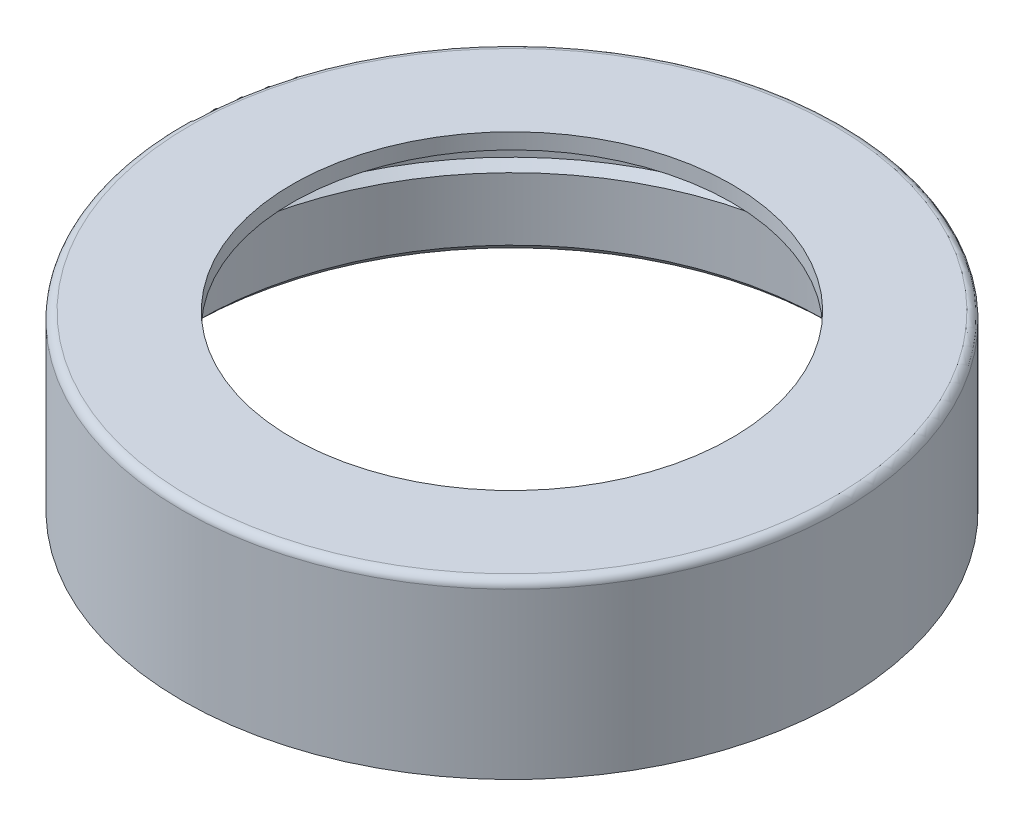
ISO-10303-21;
HEADER;
FILE_DESCRIPTION(('STEP AP214'),'2;1');
FILE_NAME('part.step','',(''),(''),'','','');
FILE_SCHEMA(('AUTOMOTIVE_DESIGN { 1 0 10303 214 1 1 1 1 }'));
ENDSEC;
DATA;
#1=APPLICATION_CONTEXT('core data for automotive mechanical design processes');
#2=APPLICATION_PROTOCOL_DEFINITION('international standard','automotive_design',2000,#1);
#3=PRODUCT_CONTEXT('',#1,'mechanical');
#4=PRODUCT('Part','Part','',(#3));
#5=PRODUCT_RELATED_PRODUCT_CATEGORY('part','',(#4));
#6=PRODUCT_DEFINITION_FORMATION('','',#4);
#7=PRODUCT_DEFINITION_CONTEXT('part definition',#1,'design');
#8=PRODUCT_DEFINITION('design','',#6,#7);
#9=PRODUCT_DEFINITION_SHAPE('','',#8);
#10=(LENGTH_UNIT() NAMED_UNIT(*) SI_UNIT(.MILLI.,.METRE.));
#11=(NAMED_UNIT(*) PLANE_ANGLE_UNIT() SI_UNIT($,.RADIAN.));
#12=(NAMED_UNIT(*) SI_UNIT($,.STERADIAN.) SOLID_ANGLE_UNIT());
#13=UNCERTAINTY_MEASURE_WITH_UNIT(LENGTH_MEASURE(1.E-05),#10,'distance_accuracy_value','');
#14=(GEOMETRIC_REPRESENTATION_CONTEXT(3) GLOBAL_UNCERTAINTY_ASSIGNED_CONTEXT((#13)) GLOBAL_UNIT_ASSIGNED_CONTEXT((#10,
#11,#12)) REPRESENTATION_CONTEXT('',''));
#15=CARTESIAN_POINT('',(0.,0.,0.));
#16=DIRECTION('',(0.,0.,1.));
#17=DIRECTION('',(1.,0.,0.));
#18=AXIS2_PLACEMENT_3D('',#15,#16,#17);
#19=CARTESIAN_POINT('',(-20.5,0.,0.));
#20=DIRECTION('',(0.,1.,0.));
#21=DIRECTION('',(0.,0.,1.));
#22=AXIS2_PLACEMENT_3D('',#19,#20,#21);
#23=PLANE('',#22);
#24=CARTESIAN_POINT('',(0.,0.,0.));
#25=DIRECTION('',(0.,-1.,0.));
#26=DIRECTION('',(0.,0.,-1.));
#27=AXIS2_PLACEMENT_3D('',#24,#25,#26);
#28=CIRCLE('',#27,20.5);
#29=CARTESIAN_POINT('',(0.,0.,-20.5));
#30=VERTEX_POINT('',#29);
#31=EDGE_CURVE('E75',#30,#30,#28,.T.);
#32=ORIENTED_EDGE('',*,*,#31,.F.);
#33=EDGE_LOOP('',(#32));
#34=FACE_BOUND('',#33,.T.);
#35=CARTESIAN_POINT('',(0.,0.,0.));
#36=DIRECTION('',(0.,-1.,0.));
#37=DIRECTION('',(0.,0.,-1.));
#38=AXIS2_PLACEMENT_3D('',#35,#36,#37);
#39=CIRCLE('',#38,21.);
#40=CARTESIAN_POINT('',(0.,0.,-21.));
#41=VERTEX_POINT('',#40);
#42=EDGE_CURVE('E45',#41,#41,#39,.T.);
#43=ORIENTED_EDGE('',*,*,#42,.T.);
#44=EDGE_LOOP('',(#43));
#45=FACE_BOUND('',#44,.T.);
#46=ADVANCED_FACE('F34',(#34,#45),#23,.F.);
#47=CARTESIAN_POINT('',(0.,0.,0.));
#48=DIRECTION('',(0.,-1.,0.));
#49=DIRECTION('',(0.,0.,-1.));
#50=AXIS2_PLACEMENT_3D('',#47,#48,#49);
#51=CYLINDRICAL_SURFACE('',#50,21.);
#52=CARTESIAN_POINT('',(0.,10.5,0.));
#53=DIRECTION('',(0.,-1.,0.));
#54=DIRECTION('',(0.,0.,-1.));
#55=AXIS2_PLACEMENT_3D('',#52,#53,#54);
#56=CIRCLE('',#55,21.);
#57=CARTESIAN_POINT('',(0.,10.5,-21.));
#58=VERTEX_POINT('',#57);
#59=EDGE_CURVE('E41',#58,#58,#56,.T.);
#60=ORIENTED_EDGE('',*,*,#59,.T.);
#61=EDGE_LOOP('',(#60));
#62=FACE_BOUND('',#61,.T.);
#63=ORIENTED_EDGE('',*,*,#42,.F.);
#64=EDGE_LOOP('',(#63));
#65=FACE_BOUND('',#64,.T.);
#66=ADVANCED_FACE('F83',(#62,#65),#51,.T.);
#67=CARTESIAN_POINT('',(-21.,11.,0.));
#68=DIRECTION('',(0.,-1.,0.));
#69=DIRECTION('',(0.,0.,-1.));
#70=AXIS2_PLACEMENT_3D('',#67,#68,#69);
#71=PLANE('',#70);
#72=CARTESIAN_POINT('',(0.,11.,0.));
#73=DIRECTION('',(0.,-1.,0.));
#74=DIRECTION('',(0.,0.,-1.));
#75=AXIS2_PLACEMENT_3D('',#72,#73,#74);
#76=CIRCLE('',#75,20.5);
#77=CARTESIAN_POINT('',(0.,11.,-20.5));
#78=VERTEX_POINT('',#77);
#79=EDGE_CURVE('E10',#78,#78,#76,.F.);
#80=ORIENTED_EDGE('',*,*,#79,.T.);
#81=EDGE_LOOP('',(#80));
#82=FACE_BOUND('',#81,.T.);
#83=CARTESIAN_POINT('',(0.,11.,0.));
#84=DIRECTION('',(0.,-1.,0.));
#85=DIRECTION('',(0.,0.,-1.));
#86=AXIS2_PLACEMENT_3D('',#83,#84,#85);
#87=CIRCLE('',#86,14.);
#88=CARTESIAN_POINT('',(0.,11.,-14.));
#89=VERTEX_POINT('',#88);
#90=EDGE_CURVE('E49',#89,#89,#87,.T.);
#91=ORIENTED_EDGE('',*,*,#90,.T.);
#92=EDGE_LOOP('',(#91));
#93=FACE_BOUND('',#92,.T.);
#94=ADVANCED_FACE('F87',(#82,#93),#71,.F.);
#95=CARTESIAN_POINT('',(0.,0.,0.));
#96=DIRECTION('',(0.,-1.,0.));
#97=DIRECTION('',(0.,0.,-1.));
#98=AXIS2_PLACEMENT_3D('',#95,#96,#97);
#99=CYLINDRICAL_SURFACE('',#98,14.);
#100=ORIENTED_EDGE('',*,*,#90,.F.);
#101=EDGE_LOOP('',(#100));
#102=FACE_BOUND('',#101,.T.);
#103=CARTESIAN_POINT('',(0.,10.,0.));
#104=DIRECTION('',(0.,-1.,0.));
#105=DIRECTION('',(0.,0.,-1.));
#106=AXIS2_PLACEMENT_3D('',#103,#104,#105);
#107=CIRCLE('',#106,14.);
#108=CARTESIAN_POINT('',(0.,10.,-14.));
#109=VERTEX_POINT('',#108);
#110=EDGE_CURVE('E54',#109,#109,#107,.T.);
#111=ORIENTED_EDGE('',*,*,#110,.T.);
#112=EDGE_LOOP('',(#111));
#113=FACE_BOUND('',#112,.T.);
#114=ADVANCED_FACE('F92',(#102,#113),#99,.F.);
#115=CARTESIAN_POINT('',(-14.,10.,0.));
#116=DIRECTION('',(0.,1.,0.));
#117=DIRECTION('',(0.,0.,1.));
#118=AXIS2_PLACEMENT_3D('',#115,#116,#117);
#119=PLANE('',#118);
#120=ORIENTED_EDGE('',*,*,#110,.F.);
#121=EDGE_LOOP('',(#120));
#122=FACE_BOUND('',#121,.T.);
#123=CARTESIAN_POINT('',(0.,10.,0.));
#124=DIRECTION('',(0.,-1.,0.));
#125=DIRECTION('',(0.,0.,-1.));
#126=AXIS2_PLACEMENT_3D('',#123,#124,#125);
#127=CIRCLE('',#126,20.);
#128=CARTESIAN_POINT('',(0.,10.,-20.));
#129=VERTEX_POINT('',#128);
#130=EDGE_CURVE('E57',#129,#129,#127,.T.);
#131=ORIENTED_EDGE('',*,*,#130,.T.);
#132=EDGE_LOOP('',(#131));
#133=FACE_BOUND('',#132,.T.);
#134=ADVANCED_FACE('F97',(#122,#133),#119,.F.);
#135=CARTESIAN_POINT('',(0.,0.,0.));
#136=DIRECTION('',(0.,-1.,0.));
#137=DIRECTION('',(0.,0.,-1.));
#138=AXIS2_PLACEMENT_3D('',#135,#136,#137);
#139=CYLINDRICAL_SURFACE('',#138,20.);
#140=ORIENTED_EDGE('',*,*,#130,.F.);
#141=EDGE_LOOP('',(#140));
#142=FACE_BOUND('',#141,.T.);
#143=CARTESIAN_POINT('',(0.,6.00000000000001,0.));
#144=DIRECTION('',(0.,-1.,0.));
#145=DIRECTION('',(0.,0.,-1.));
#146=AXIS2_PLACEMENT_3D('',#143,#144,#145);
#147=CIRCLE('',#146,20.);
#148=CARTESIAN_POINT('',(0.,6.00000000000001,-20.));
#149=VERTEX_POINT('',#148);
#150=EDGE_CURVE('E60',#149,#149,#147,.T.);
#151=ORIENTED_EDGE('',*,*,#150,.T.);
#152=EDGE_LOOP('',(#151));
#153=FACE_BOUND('',#152,.T.);
#154=ADVANCED_FACE('F101',(#142,#153),#139,.F.);
#155=CARTESIAN_POINT('',(-20.5,6.00000000000001,0.));
#156=DIRECTION('',(0.,1.,0.));
#157=DIRECTION('',(0.,0.,1.));
#158=AXIS2_PLACEMENT_3D('',#155,#156,#157);
#159=PLANE('',#158);
#160=ORIENTED_EDGE('',*,*,#150,.F.);
#161=EDGE_LOOP('',(#160));
#162=FACE_BOUND('',#161,.T.);
#163=CARTESIAN_POINT('',(0.,6.00000000000001,0.));
#164=DIRECTION('',(0.,-1.,0.));
#165=DIRECTION('',(0.,0.,-1.));
#166=AXIS2_PLACEMENT_3D('',#163,#164,#165);
#167=CIRCLE('',#166,20.5);
#168=CARTESIAN_POINT('',(0.,6.00000000000001,-20.5));
#169=VERTEX_POINT('',#168);
#170=EDGE_CURVE('E63',#169,#169,#167,.T.);
#171=ORIENTED_EDGE('',*,*,#170,.T.);
#172=EDGE_LOOP('',(#171));
#173=FACE_BOUND('',#172,.T.);
#174=ADVANCED_FACE('F105',(#162,#173),#159,.F.);
#175=CARTESIAN_POINT('',(0.,0.,0.));
#176=DIRECTION('',(0.,-1.,0.));
#177=DIRECTION('',(0.,0.,-1.));
#178=AXIS2_PLACEMENT_3D('',#175,#176,#177);
#179=CYLINDRICAL_SURFACE('',#178,20.5);
#180=ORIENTED_EDGE('',*,*,#170,.F.);
#181=EDGE_LOOP('',(#180));
#182=FACE_BOUND('',#181,.T.);
#183=CARTESIAN_POINT('',(0.,5.00000000000001,0.));
#184=DIRECTION('',(0.,-1.,0.));
#185=DIRECTION('',(0.,0.,-1.));
#186=AXIS2_PLACEMENT_3D('',#183,#184,#185);
#187=CIRCLE('',#186,20.5);
#188=CARTESIAN_POINT('',(0.,5.00000000000001,-20.5));
#189=VERTEX_POINT('',#188);
#190=EDGE_CURVE('E66',#189,#189,#187,.T.);
#191=ORIENTED_EDGE('',*,*,#190,.T.);
#192=EDGE_LOOP('',(#191));
#193=FACE_BOUND('',#192,.T.);
#194=ADVANCED_FACE('F109',(#182,#193),#179,.F.);
#195=CARTESIAN_POINT('',(0.,4.50000000000001,0.));
#196=DIRECTION('',(0.,1.,0.));
#197=DIRECTION('',(0.,0.,1.));
#198=AXIS2_PLACEMENT_3D('',#195,#196,#197);
#199=CONICAL_SURFACE('',#198,20.,0.785398163397445);
#200=ORIENTED_EDGE('',*,*,#190,.F.);
#201=EDGE_LOOP('',(#200));
#202=FACE_BOUND('',#201,.T.);
#203=CARTESIAN_POINT('',(0.,4.50000000000001,0.));
#204=DIRECTION('',(0.,-1.,0.));
#205=DIRECTION('',(0.,0.,-1.));
#206=AXIS2_PLACEMENT_3D('',#203,#204,#205);
#207=CIRCLE('',#206,20.);
#208=CARTESIAN_POINT('',(0.,4.50000000000001,-20.));
#209=VERTEX_POINT('',#208);
#210=EDGE_CURVE('E69',#209,#209,#207,.T.);
#211=ORIENTED_EDGE('',*,*,#210,.T.);
#212=EDGE_LOOP('',(#211));
#213=FACE_BOUND('',#212,.T.);
#214=ADVANCED_FACE('F113',(#202,#213),#199,.F.);
#215=CARTESIAN_POINT('',(0.,0.,0.));
#216=DIRECTION('',(0.,-1.,0.));
#217=DIRECTION('',(0.,0.,-1.));
#218=AXIS2_PLACEMENT_3D('',#215,#216,#217);
#219=CYLINDRICAL_SURFACE('',#218,20.);
#220=ORIENTED_EDGE('',*,*,#210,.F.);
#221=EDGE_LOOP('',(#220));
#222=FACE_BOUND('',#221,.T.);
#223=CARTESIAN_POINT('',(0.,0.50000000000001,0.));
#224=DIRECTION('',(0.,-1.,0.));
#225=DIRECTION('',(0.,0.,-1.));
#226=AXIS2_PLACEMENT_3D('',#223,#224,#225);
#227=CIRCLE('',#226,20.);
#228=CARTESIAN_POINT('',(0.,0.50000000000001,-20.));
#229=VERTEX_POINT('',#228);
#230=EDGE_CURVE('E72',#229,#229,#227,.T.);
#231=ORIENTED_EDGE('',*,*,#230,.T.);
#232=EDGE_LOOP('',(#231));
#233=FACE_BOUND('',#232,.T.);
#234=ADVANCED_FACE('F117',(#222,#233),#219,.F.);
#235=CARTESIAN_POINT('',(0.,0.,0.));
#236=DIRECTION('',(0.,-1.,0.));
#237=DIRECTION('',(0.,0.,-1.));
#238=AXIS2_PLACEMENT_3D('',#235,#236,#237);
#239=CONICAL_SURFACE('',#238,20.5,0.785398163397449);
#240=ORIENTED_EDGE('',*,*,#230,.F.);
#241=EDGE_LOOP('',(#240));
#242=FACE_BOUND('',#241,.T.);
#243=ORIENTED_EDGE('',*,*,#31,.T.);
#244=EDGE_LOOP('',(#243));
#245=FACE_BOUND('',#244,.T.);
#246=ADVANCED_FACE('F79',(#242,#245),#239,.F.);
#247=CARTESIAN_POINT('',(0.,10.5,0.));
#248=DIRECTION('',(0.,-1.,0.));
#249=DIRECTION('',(0.,0.,-1.));
#250=AXIS2_PLACEMENT_3D('',#247,#248,#249);
#251=TOROIDAL_SURFACE('',#250,20.5,0.5);
#252=ORIENTED_EDGE('',*,*,#79,.F.);
#253=EDGE_LOOP('',(#252));
#254=FACE_BOUND('',#253,.T.);
#255=ORIENTED_EDGE('',*,*,#59,.F.);
#256=EDGE_LOOP('',(#255));
#257=FACE_BOUND('',#256,.T.);
#258=ADVANCED_FACE('F36',(#254,#257),#251,.T.);
#259=CLOSED_SHELL('',(#46,#66,#94,#114,#134,#154,#174,#194,#214,#234,#246,#258));
#260=MANIFOLD_SOLID_BREP('B2',#259);
#261=ADVANCED_BREP_SHAPE_REPRESENTATION('',(#18,#260),#14);
#262=SHAPE_DEFINITION_REPRESENTATION(#9,#261);
ENDSEC;
END-ISO-10303-21;
